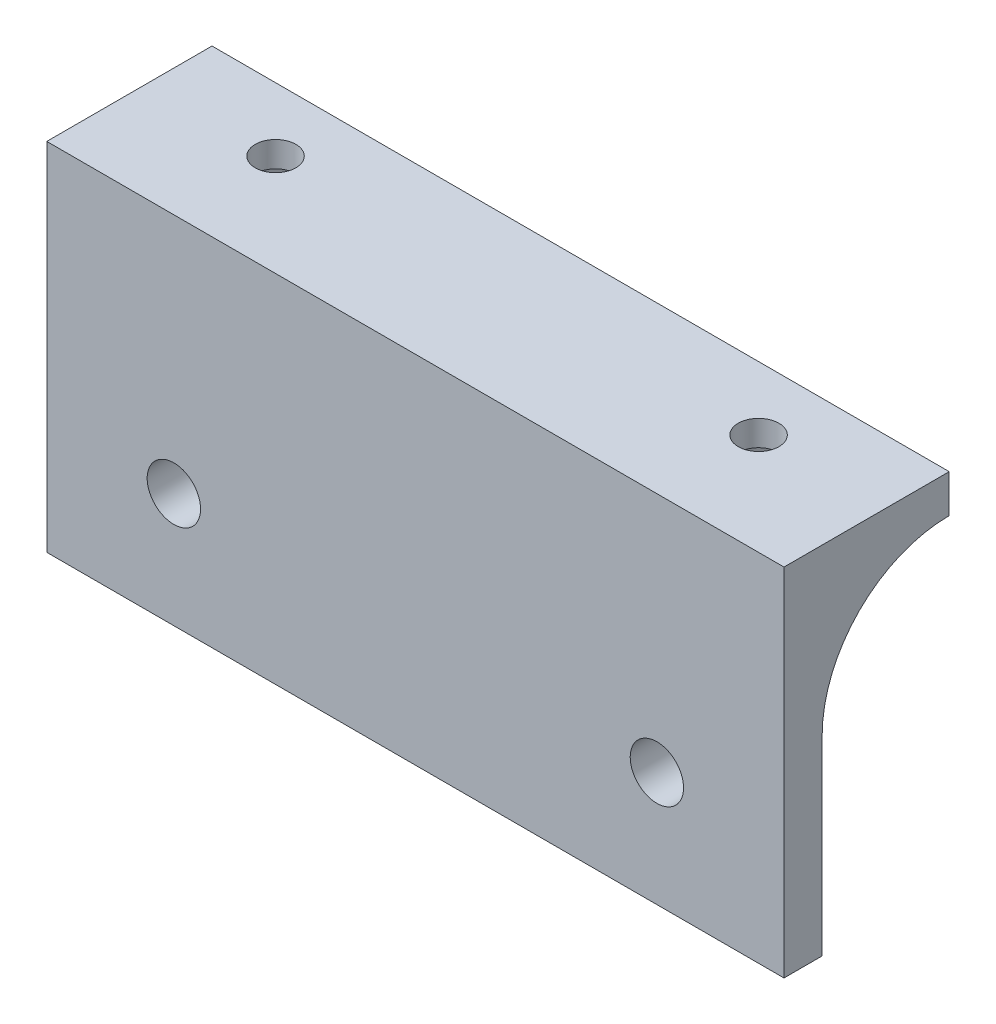
ISO-10303-21;
HEADER;
FILE_DESCRIPTION(('STEP AP214'),'2;1');
FILE_NAME('part.step','',(''),(''),'','','');
FILE_SCHEMA(('AUTOMOTIVE_DESIGN { 1 0 10303 214 1 1 1 1 }'));
ENDSEC;
DATA;
#1=APPLICATION_CONTEXT('core data for automotive mechanical design processes');
#2=APPLICATION_PROTOCOL_DEFINITION('international standard','automotive_design',2000,#1);
#3=PRODUCT_CONTEXT('',#1,'mechanical');
#4=PRODUCT('Part','Part','',(#3));
#5=PRODUCT_RELATED_PRODUCT_CATEGORY('part','',(#4));
#6=PRODUCT_DEFINITION_FORMATION('','',#4);
#7=PRODUCT_DEFINITION_CONTEXT('part definition',#1,'design');
#8=PRODUCT_DEFINITION('design','',#6,#7);
#9=PRODUCT_DEFINITION_SHAPE('','',#8);
#10=(LENGTH_UNIT() NAMED_UNIT(*) SI_UNIT(.MILLI.,.METRE.));
#11=(NAMED_UNIT(*) PLANE_ANGLE_UNIT() SI_UNIT($,.RADIAN.));
#12=(NAMED_UNIT(*) SI_UNIT($,.STERADIAN.) SOLID_ANGLE_UNIT());
#13=UNCERTAINTY_MEASURE_WITH_UNIT(LENGTH_MEASURE(1.E-05),#10,'distance_accuracy_value','');
#14=(GEOMETRIC_REPRESENTATION_CONTEXT(3) GLOBAL_UNCERTAINTY_ASSIGNED_CONTEXT((#13)) GLOBAL_UNIT_ASSIGNED_CONTEXT((#10,
#11,#12)) REPRESENTATION_CONTEXT('',''));
#15=CARTESIAN_POINT('',(0.,0.,0.));
#16=DIRECTION('',(0.,0.,1.));
#17=DIRECTION('',(1.,0.,0.));
#18=AXIS2_PLACEMENT_3D('',#15,#16,#17);
#19=CARTESIAN_POINT('',(19.,11.,-5.));
#20=DIRECTION('',(0.,1.,0.));
#21=DIRECTION('',(-1.,0.,0.));
#22=AXIS2_PLACEMENT_3D('',#19,#20,#21);
#23=CYLINDRICAL_SURFACE('',#22,1.6);
#24=CARTESIAN_POINT('',(19.,14.,-5.));
#25=DIRECTION('',(0.,1.,0.));
#26=DIRECTION('',(1.,0.,0.));
#27=AXIS2_PLACEMENT_3D('',#24,#25,#26);
#28=CIRCLE('',#27,1.6);
#29=CARTESIAN_POINT('',(20.6,14.,-5.));
#30=VERTEX_POINT('',#29);
#31=EDGE_CURVE('E180',#30,#30,#28,.T.);
#32=ORIENTED_EDGE('',*,*,#31,.T.);
#33=EDGE_LOOP('',(#32));
#34=FACE_BOUND('',#33,.T.);
#35=CARTESIAN_POINT('',(19.,12.,-5.));
#36=DIRECTION('',(0.,-1.,0.));
#37=DIRECTION('',(0.,0.,-1.));
#38=AXIS2_PLACEMENT_3D('',#35,#36,#37);
#39=CIRCLE('',#38,1.6);
#40=CARTESIAN_POINT('',(19.,12.,-6.60000000000001));
#41=VERTEX_POINT('',#40);
#42=EDGE_CURVE('E181',#41,#41,#39,.F.);
#43=ORIENTED_EDGE('',*,*,#42,.F.);
#44=EDGE_LOOP('',(#43));
#45=FACE_BOUND('',#44,.T.);
#46=ADVANCED_FACE('F33',(#34,#45),#23,.F.);
#47=CARTESIAN_POINT('',(0.,0.,0.));
#48=DIRECTION('',(0.,0.,1.));
#49=DIRECTION('',(1.,0.,0.));
#50=AXIS2_PLACEMENT_3D('',#47,#48,#49);
#51=PLANE('',#50);
#52=CARTESIAN_POINT('',(19.,-4.99999999999999,0.));
#53=DIRECTION('',(0.,0.,1.));
#54=DIRECTION('',(-1.,0.,0.));
#55=AXIS2_PLACEMENT_3D('',#52,#53,#54);
#56=CIRCLE('',#55,2.1);
#57=CARTESIAN_POINT('',(16.9,-4.99999999999999,0.));
#58=VERTEX_POINT('',#57);
#59=EDGE_CURVE('E259',#58,#58,#56,.T.);
#60=ORIENTED_EDGE('',*,*,#59,.T.);
#61=EDGE_LOOP('',(#60));
#62=FACE_BOUND('',#61,.T.);
#63=CARTESIAN_POINT('',(-19.,-5.,0.));
#64=DIRECTION('',(0.,0.,1.));
#65=DIRECTION('',(1.,0.,0.));
#66=AXIS2_PLACEMENT_3D('',#63,#64,#65);
#67=CIRCLE('',#66,2.1);
#68=CARTESIAN_POINT('',(-16.9,-5.,0.));
#69=VERTEX_POINT('',#68);
#70=EDGE_CURVE('E167',#69,#69,#67,.T.);
#71=ORIENTED_EDGE('',*,*,#70,.T.);
#72=EDGE_LOOP('',(#71));
#73=FACE_BOUND('',#72,.T.);
#74=DIRECTION('',(0.,-1.,0.));
#75=VECTOR('',#74,1.);
#76=CARTESIAN_POINT('',(-29.,14.,0.));
#77=LINE('',#76,#75);
#78=CARTESIAN_POINT('',(-29.,1.,0.));
#79=VERTEX_POINT('',#78);
#80=CARTESIAN_POINT('',(-29.,-14.,0.));
#81=VERTEX_POINT('',#80);
#82=EDGE_CURVE('E150',#79,#81,#77,.T.);
#83=ORIENTED_EDGE('',*,*,#82,.F.);
#84=DIRECTION('',(-1.,0.,0.));
#85=VECTOR('',#84,1.);
#86=CARTESIAN_POINT('',(29.,1.00000000000001,0.));
#87=LINE('',#86,#85);
#88=CARTESIAN_POINT('',(29.,1.00000000000001,0.));
#89=VERTEX_POINT('',#88);
#90=EDGE_CURVE('E162',#79,#89,#87,.F.);
#91=ORIENTED_EDGE('',*,*,#90,.T.);
#92=DIRECTION('',(0.,1.,0.));
#93=VECTOR('',#92,1.);
#94=CARTESIAN_POINT('',(29.,14.,0.));
#95=LINE('',#94,#93);
#96=CARTESIAN_POINT('',(29.,-14.,0.));
#97=VERTEX_POINT('',#96);
#98=EDGE_CURVE('E156',#97,#89,#95,.T.);
#99=ORIENTED_EDGE('',*,*,#98,.F.);
#100=DIRECTION('',(1.,0.,0.));
#101=VECTOR('',#100,1.);
#102=CARTESIAN_POINT('',(-29.,-14.,0.));
#103=LINE('',#102,#101);
#104=EDGE_CURVE('E139',#81,#97,#103,.T.);
#105=ORIENTED_EDGE('',*,*,#104,.F.);
#106=EDGE_LOOP('',(#83,#91,#99,#105));
#107=FACE_BOUND('',#106,.T.);
#108=ADVANCED_FACE('F160',(#62,#73,#107),#51,.F.);
#109=CARTESIAN_POINT('',(0.,0.,3.));
#110=DIRECTION('',(0.,0.,1.));
#111=DIRECTION('',(1.,0.,0.));
#112=AXIS2_PLACEMENT_3D('',#109,#110,#111);
#113=PLANE('',#112);
#114=DIRECTION('',(0.,-1.,0.));
#115=VECTOR('',#114,1.);
#116=CARTESIAN_POINT('',(-29.,14.,3.));
#117=LINE('',#116,#115);
#118=CARTESIAN_POINT('',(-29.,14.,3.));
#119=VERTEX_POINT('',#118);
#120=CARTESIAN_POINT('',(-29.,-14.,3.));
#121=VERTEX_POINT('',#120);
#122=EDGE_CURVE('E271',#119,#121,#117,.T.);
#123=ORIENTED_EDGE('',*,*,#122,.T.);
#124=DIRECTION('',(1.,0.,0.));
#125=VECTOR('',#124,1.);
#126=CARTESIAN_POINT('',(-29.,-14.,3.));
#127=LINE('',#126,#125);
#128=CARTESIAN_POINT('',(29.,-14.,3.));
#129=VERTEX_POINT('',#128);
#130=EDGE_CURVE('E158',#121,#129,#127,.T.);
#131=ORIENTED_EDGE('',*,*,#130,.T.);
#132=DIRECTION('',(0.,1.,0.));
#133=VECTOR('',#132,1.);
#134=CARTESIAN_POINT('',(29.,14.,3.));
#135=LINE('',#134,#133);
#136=CARTESIAN_POINT('',(29.,14.,3.));
#137=VERTEX_POINT('',#136);
#138=EDGE_CURVE('E149',#129,#137,#135,.T.);
#139=ORIENTED_EDGE('',*,*,#138,.T.);
#140=DIRECTION('',(-1.,0.,0.));
#141=VECTOR('',#140,1.);
#142=CARTESIAN_POINT('',(-29.,14.,3.));
#143=LINE('',#142,#141);
#144=EDGE_CURVE('E270',#137,#119,#143,.T.);
#145=ORIENTED_EDGE('',*,*,#144,.T.);
#146=EDGE_LOOP('',(#123,#131,#139,#145));
#147=FACE_BOUND('',#146,.T.);
#148=CARTESIAN_POINT('',(19.,-4.99999999999999,3.));
#149=DIRECTION('',(0.,0.,1.));
#150=DIRECTION('',(-1.,0.,0.));
#151=AXIS2_PLACEMENT_3D('',#148,#149,#150);
#152=CIRCLE('',#151,2.1);
#153=CARTESIAN_POINT('',(16.9,-4.99999999999999,3.));
#154=VERTEX_POINT('',#153);
#155=EDGE_CURVE('E262',#154,#154,#152,.T.);
#156=ORIENTED_EDGE('',*,*,#155,.F.);
#157=EDGE_LOOP('',(#156));
#158=FACE_BOUND('',#157,.T.);
#159=CARTESIAN_POINT('',(-19.,-5.,3.));
#160=DIRECTION('',(0.,0.,1.));
#161=DIRECTION('',(1.,0.,0.));
#162=AXIS2_PLACEMENT_3D('',#159,#160,#161);
#163=CIRCLE('',#162,2.1);
#164=CARTESIAN_POINT('',(-16.9,-5.,3.));
#165=VERTEX_POINT('',#164);
#166=EDGE_CURVE('E163',#165,#165,#163,.T.);
#167=ORIENTED_EDGE('',*,*,#166,.F.);
#168=EDGE_LOOP('',(#167));
#169=FACE_BOUND('',#168,.T.);
#170=ADVANCED_FACE('F274',(#147,#158,#169),#113,.T.);
#171=CARTESIAN_POINT('',(29.,14.,3.));
#172=DIRECTION('',(-1.,0.,0.));
#173=DIRECTION('',(0.,-1.,0.));
#174=AXIS2_PLACEMENT_3D('',#171,#172,#173);
#175=PLANE('',#174);
#176=DIRECTION('',(0.,0.,-1.));
#177=VECTOR('',#176,1.);
#178=CARTESIAN_POINT('',(29.,14.,3.));
#179=LINE('',#178,#177);
#180=CARTESIAN_POINT('',(29.,14.,-10.));
#181=VERTEX_POINT('',#180);
#182=EDGE_CURVE('E175',#137,#181,#179,.T.);
#183=ORIENTED_EDGE('',*,*,#182,.F.);
#184=ORIENTED_EDGE('',*,*,#138,.F.);
#185=DIRECTION('',(0.,0.,-1.));
#186=VECTOR('',#185,1.);
#187=CARTESIAN_POINT('',(29.,-14.,3.));
#188=LINE('',#187,#186);
#189=EDGE_CURVE('E143',#129,#97,#188,.T.);
#190=ORIENTED_EDGE('',*,*,#189,.T.);
#191=ORIENTED_EDGE('',*,*,#98,.T.);
#192=CARTESIAN_POINT('',(29.,1.00000000000001,-10.));
#193=DIRECTION('',(-1.,0.,0.));
#194=DIRECTION('',(0.,-1.,0.));
#195=AXIS2_PLACEMENT_3D('',#192,#193,#194);
#196=CIRCLE('',#195,10.);
#197=CARTESIAN_POINT('',(29.,11.,-10.));
#198=VERTEX_POINT('',#197);
#199=EDGE_CURVE('E11',#89,#198,#196,.T.);
#200=ORIENTED_EDGE('',*,*,#199,.T.);
#201=DIRECTION('',(0.,1.,0.));
#202=VECTOR('',#201,1.);
#203=CARTESIAN_POINT('',(29.,11.,-10.));
#204=LINE('',#203,#202);
#205=EDGE_CURVE('E253',#198,#181,#204,.T.);
#206=ORIENTED_EDGE('',*,*,#205,.T.);
#207=EDGE_LOOP('',(#183,#184,#190,#191,#200,#206));
#208=FACE_BOUND('',#207,.T.);
#209=ADVANCED_FACE('F155',(#208),#175,.F.);
#210=CARTESIAN_POINT('',(-29.,14.,3.));
#211=DIRECTION('',(0.,-1.,0.));
#212=DIRECTION('',(1.,0.,0.));
#213=AXIS2_PLACEMENT_3D('',#210,#211,#212);
#214=PLANE('',#213);
#215=ORIENTED_EDGE('',*,*,#182,.T.);
#216=DIRECTION('',(-1.,0.,0.));
#217=VECTOR('',#216,1.);
#218=CARTESIAN_POINT('',(29.,14.,-10.));
#219=LINE('',#218,#217);
#220=CARTESIAN_POINT('',(-29.,14.,-9.99999999999999));
#221=VERTEX_POINT('',#220);
#222=EDGE_CURVE('E249',#181,#221,#219,.T.);
#223=ORIENTED_EDGE('',*,*,#222,.T.);
#224=DIRECTION('',(0.,0.,-1.));
#225=VECTOR('',#224,1.);
#226=CARTESIAN_POINT('',(-29.,14.,3.));
#227=LINE('',#226,#225);
#228=EDGE_CURVE('E173',#119,#221,#227,.T.);
#229=ORIENTED_EDGE('',*,*,#228,.F.);
#230=ORIENTED_EDGE('',*,*,#144,.F.);
#231=EDGE_LOOP('',(#215,#223,#229,#230));
#232=FACE_BOUND('',#231,.T.);
#233=CARTESIAN_POINT('',(-19.,14.,-5.));
#234=DIRECTION('',(0.,1.,0.));
#235=DIRECTION('',(-1.,0.,0.));
#236=AXIS2_PLACEMENT_3D('',#233,#234,#235);
#237=CIRCLE('',#236,1.6);
#238=CARTESIAN_POINT('',(-20.6,14.,-5.));
#239=VERTEX_POINT('',#238);
#240=EDGE_CURVE('E246',#239,#239,#237,.T.);
#241=ORIENTED_EDGE('',*,*,#240,.F.);
#242=EDGE_LOOP('',(#241));
#243=FACE_BOUND('',#242,.T.);
#244=ORIENTED_EDGE('',*,*,#31,.F.);
#245=EDGE_LOOP('',(#244));
#246=FACE_BOUND('',#245,.T.);
#247=ADVANCED_FACE('F279',(#232,#243,#246),#214,.F.);
#248=CARTESIAN_POINT('',(-29.,14.,3.));
#249=DIRECTION('',(1.,0.,0.));
#250=DIRECTION('',(0.,1.,0.));
#251=AXIS2_PLACEMENT_3D('',#248,#249,#250);
#252=PLANE('',#251);
#253=ORIENTED_EDGE('',*,*,#228,.T.);
#254=DIRECTION('',(0.,1.,0.));
#255=VECTOR('',#254,1.);
#256=CARTESIAN_POINT('',(-29.,11.,-9.99999999999999));
#257=LINE('',#256,#255);
#258=CARTESIAN_POINT('',(-29.,11.,-9.99999999999999));
#259=VERTEX_POINT('',#258);
#260=EDGE_CURVE('E256',#259,#221,#257,.T.);
#261=ORIENTED_EDGE('',*,*,#260,.F.);
#262=CARTESIAN_POINT('',(-29.,1.,-10.));
#263=DIRECTION('',(1.,0.,0.));
#264=DIRECTION('',(0.,1.,0.));
#265=AXIS2_PLACEMENT_3D('',#262,#263,#264);
#266=CIRCLE('',#265,10.);
#267=EDGE_CURVE('E43',#259,#79,#266,.T.);
#268=ORIENTED_EDGE('',*,*,#267,.T.);
#269=ORIENTED_EDGE('',*,*,#82,.T.);
#270=DIRECTION('',(0.,0.,-1.));
#271=VECTOR('',#270,1.);
#272=CARTESIAN_POINT('',(-29.,-14.,3.));
#273=LINE('',#272,#271);
#274=EDGE_CURVE('E146',#121,#81,#273,.T.);
#275=ORIENTED_EDGE('',*,*,#274,.F.);
#276=ORIENTED_EDGE('',*,*,#122,.F.);
#277=EDGE_LOOP('',(#253,#261,#268,#269,#275,#276));
#278=FACE_BOUND('',#277,.T.);
#279=ADVANCED_FACE('F286',(#278),#252,.F.);
#280=CARTESIAN_POINT('',(-29.,-14.,3.));
#281=DIRECTION('',(0.,1.,0.));
#282=DIRECTION('',(-1.,0.,0.));
#283=AXIS2_PLACEMENT_3D('',#280,#281,#282);
#284=PLANE('',#283);
#285=ORIENTED_EDGE('',*,*,#104,.T.);
#286=ORIENTED_EDGE('',*,*,#189,.F.);
#287=ORIENTED_EDGE('',*,*,#130,.F.);
#288=ORIENTED_EDGE('',*,*,#274,.T.);
#289=EDGE_LOOP('',(#285,#286,#287,#288));
#290=FACE_BOUND('',#289,.T.);
#291=ADVANCED_FACE('F141',(#290),#284,.F.);
#292=CARTESIAN_POINT('',(-19.,-5.,3.));
#293=DIRECTION('',(0.,0.,-1.));
#294=DIRECTION('',(-1.,0.,0.));
#295=AXIS2_PLACEMENT_3D('',#292,#293,#294);
#296=CYLINDRICAL_SURFACE('',#295,2.1);
#297=ORIENTED_EDGE('',*,*,#166,.T.);
#298=EDGE_LOOP('',(#297));
#299=FACE_BOUND('',#298,.T.);
#300=ORIENTED_EDGE('',*,*,#70,.F.);
#301=EDGE_LOOP('',(#300));
#302=FACE_BOUND('',#301,.T.);
#303=ADVANCED_FACE('F387',(#299,#302),#296,.F.);
#304=CARTESIAN_POINT('',(19.,-4.99999999999999,3.));
#305=DIRECTION('',(0.,0.,-1.));
#306=DIRECTION('',(-1.,0.,0.));
#307=AXIS2_PLACEMENT_3D('',#304,#305,#306);
#308=CYLINDRICAL_SURFACE('',#307,2.1);
#309=ORIENTED_EDGE('',*,*,#155,.T.);
#310=EDGE_LOOP('',(#309));
#311=FACE_BOUND('',#310,.T.);
#312=ORIENTED_EDGE('',*,*,#59,.F.);
#313=EDGE_LOOP('',(#312));
#314=FACE_BOUND('',#313,.T.);
#315=ADVANCED_FACE('F384',(#311,#314),#308,.F.);
#316=CARTESIAN_POINT('',(29.,11.,-10.));
#317=DIRECTION('',(0.,0.,-1.));
#318=DIRECTION('',(-1.,0.,0.));
#319=AXIS2_PLACEMENT_3D('',#316,#317,#318);
#320=PLANE('',#319);
#321=ORIENTED_EDGE('',*,*,#222,.F.);
#322=ORIENTED_EDGE('',*,*,#205,.F.);
#323=DIRECTION('',(-1.,0.,0.));
#324=VECTOR('',#323,1.);
#325=CARTESIAN_POINT('',(29.,11.,-10.));
#326=LINE('',#325,#324);
#327=EDGE_CURVE('E250',#198,#259,#326,.T.);
#328=ORIENTED_EDGE('',*,*,#327,.T.);
#329=ORIENTED_EDGE('',*,*,#260,.T.);
#330=EDGE_LOOP('',(#321,#322,#328,#329));
#331=FACE_BOUND('',#330,.T.);
#332=ADVANCED_FACE('F285',(#331),#320,.T.);
#333=CARTESIAN_POINT('',(-19.,11.,-5.));
#334=DIRECTION('',(0.,1.,0.));
#335=DIRECTION('',(-1.,0.,0.));
#336=AXIS2_PLACEMENT_3D('',#333,#334,#335);
#337=CYLINDRICAL_SURFACE('',#336,1.6);
#338=CARTESIAN_POINT('',(-19.,12.,-5.));
#339=DIRECTION('',(0.,1.,0.));
#340=DIRECTION('',(0.,0.,1.));
#341=AXIS2_PLACEMENT_3D('',#338,#339,#340);
#342=CIRCLE('',#341,1.6);
#343=CARTESIAN_POINT('',(-19.,12.,-3.4));
#344=VERTEX_POINT('',#343);
#345=EDGE_CURVE('E177',#344,#344,#342,.F.);
#346=ORIENTED_EDGE('',*,*,#345,.T.);
#347=EDGE_LOOP('',(#346));
#348=FACE_BOUND('',#347,.T.);
#349=ORIENTED_EDGE('',*,*,#240,.T.);
#350=EDGE_LOOP('',(#349));
#351=FACE_BOUND('',#350,.T.);
#352=ADVANCED_FACE('F378',(#348,#351),#337,.F.);
#353=CARTESIAN_POINT('',(-17.3834192462691,2.,-2.2));
#354=DIRECTION('',(0.866025403784439,0.,0.5));
#355=DIRECTION('',(0.5,0.,-0.866025403784439));
#356=AXIS2_PLACEMENT_3D('',#353,#354,#355);
#357=PLANE('',#356);
#358=DIRECTION('',(0.,1.,0.));
#359=VECTOR('',#358,1.);
#360=CARTESIAN_POINT('',(-17.3834192462691,2.,-2.2));
#361=LINE('',#360,#359);
#362=CARTESIAN_POINT('',(-17.3834192462691,7.25779513886481,-2.2));
#363=VERTEX_POINT('',#362);
#364=CARTESIAN_POINT('',(-17.3834192462691,12.,-2.2));
#365=VERTEX_POINT('',#364);
#366=EDGE_CURVE('E104',#363,#365,#361,.T.);
#367=ORIENTED_EDGE('',*,*,#366,.T.);
#368=DIRECTION('',(0.5,0.,-0.866025403784439));
#369=VECTOR('',#368,1.);
#370=CARTESIAN_POINT('',(-17.3834192462691,12.,-2.2));
#371=LINE('',#370,#369);
#372=CARTESIAN_POINT('',(-15.7668384925381,12.,-5.));
#373=VERTEX_POINT('',#372);
#374=EDGE_CURVE('E184',#365,#373,#371,.T.);
#375=ORIENTED_EDGE('',*,*,#374,.T.);
#376=DIRECTION('',(0.,1.,0.));
#377=VECTOR('',#376,1.);
#378=CARTESIAN_POINT('',(-15.7668384925381,2.,-5.));
#379=LINE('',#378,#377);
#380=CARTESIAN_POINT('',(-15.7668384925381,9.66025403784439,-5.));
#381=VERTEX_POINT('',#380);
#382=EDGE_CURVE('E221',#381,#373,#379,.T.);
#383=ORIENTED_EDGE('',*,*,#382,.F.);
#384=CARTESIAN_POINT('',(-12.88008714659,1.,-10.));
#385=DIRECTION('',(0.866025403784439,0.,0.5));
#386=DIRECTION('',(0.5,0.,-0.866025403784439));
#387=AXIS2_PLACEMENT_3D('',#384,#385,#386);
#388=ELLIPSE('',#387,11.5470053837925,10.);
#389=EDGE_CURVE('E37',#363,#381,#388,.F.);
#390=ORIENTED_EDGE('',*,*,#389,.F.);
#391=EDGE_LOOP('',(#367,#375,#383,#390));
#392=FACE_BOUND('',#391,.T.);
#393=ADVANCED_FACE('F220',(#392),#357,.F.);
#394=CARTESIAN_POINT('',(-20.616580753731,2.,-2.2));
#395=DIRECTION('',(0.,0.,1.));
#396=DIRECTION('',(1.,0.,0.));
#397=AXIS2_PLACEMENT_3D('',#394,#395,#396);
#398=PLANE('',#397);
#399=DIRECTION('',(0.,1.,0.));
#400=VECTOR('',#399,1.);
#401=CARTESIAN_POINT('',(-20.616580753731,2.,-2.2));
#402=LINE('',#401,#400);
#403=CARTESIAN_POINT('',(-20.616580753731,7.25779513886481,-2.2));
#404=VERTEX_POINT('',#403);
#405=CARTESIAN_POINT('',(-20.616580753731,12.,-2.2));
#406=VERTEX_POINT('',#405);
#407=EDGE_CURVE('E228',#404,#406,#402,.T.);
#408=ORIENTED_EDGE('',*,*,#407,.T.);
#409=DIRECTION('',(1.,0.,0.));
#410=VECTOR('',#409,1.);
#411=CARTESIAN_POINT('',(-20.616580753731,12.,-2.2));
#412=LINE('',#411,#410);
#413=EDGE_CURVE('E227',#406,#365,#412,.T.);
#414=ORIENTED_EDGE('',*,*,#413,.T.);
#415=ORIENTED_EDGE('',*,*,#366,.F.);
#416=DIRECTION('',(1.,0.,0.));
#417=VECTOR('',#416,1.);
#418=CARTESIAN_POINT('',(-19.,7.25779513886481,-2.2));
#419=LINE('',#418,#417);
#420=EDGE_CURVE('E206',#404,#363,#419,.T.);
#421=ORIENTED_EDGE('',*,*,#420,.F.);
#422=EDGE_LOOP('',(#408,#414,#415,#421));
#423=FACE_BOUND('',#422,.T.);
#424=ADVANCED_FACE('F224',(#423),#398,.F.);
#425=CARTESIAN_POINT('',(-22.2331615074619,2.,-5.));
#426=DIRECTION('',(-0.866025403784439,0.,0.5));
#427=DIRECTION('',(0.5,0.,0.866025403784439));
#428=AXIS2_PLACEMENT_3D('',#425,#426,#427);
#429=PLANE('',#428);
#430=DIRECTION('',(0.,1.,0.));
#431=VECTOR('',#430,1.);
#432=CARTESIAN_POINT('',(-22.2331615074619,2.,-5.));
#433=LINE('',#432,#431);
#434=CARTESIAN_POINT('',(-22.2331615074619,9.66025403784439,-5.));
#435=VERTEX_POINT('',#434);
#436=CARTESIAN_POINT('',(-22.2331615074619,12.,-5.));
#437=VERTEX_POINT('',#436);
#438=EDGE_CURVE('E230',#435,#437,#433,.T.);
#439=ORIENTED_EDGE('',*,*,#438,.T.);
#440=DIRECTION('',(0.5,0.,0.866025403784439));
#441=VECTOR('',#440,1.);
#442=CARTESIAN_POINT('',(-22.2331615074619,12.,-5.));
#443=LINE('',#442,#441);
#444=EDGE_CURVE('E333',#437,#406,#443,.T.);
#445=ORIENTED_EDGE('',*,*,#444,.T.);
#446=ORIENTED_EDGE('',*,*,#407,.F.);
#447=CARTESIAN_POINT('',(-25.11991285341,1.,-10.));
#448=DIRECTION('',(-0.866025403784439,0.,0.5));
#449=DIRECTION('',(0.5,0.,0.866025403784439));
#450=AXIS2_PLACEMENT_3D('',#447,#448,#449);
#451=ELLIPSE('',#450,11.5470053837925,10.);
#452=EDGE_CURVE('E209',#435,#404,#451,.F.);
#453=ORIENTED_EDGE('',*,*,#452,.F.);
#454=EDGE_LOOP('',(#439,#445,#446,#453));
#455=FACE_BOUND('',#454,.T.);
#456=ADVANCED_FACE('F337',(#455),#429,.F.);
#457=CARTESIAN_POINT('',(-20.616580753731,2.,-7.8));
#458=DIRECTION('',(-0.866025403784439,0.,-0.5));
#459=DIRECTION('',(-0.5,0.,0.866025403784439));
#460=AXIS2_PLACEMENT_3D('',#457,#458,#459);
#461=PLANE('',#460);
#462=DIRECTION('',(0.,1.,0.));
#463=VECTOR('',#462,1.);
#464=CARTESIAN_POINT('',(-20.616580753731,2.,-7.8));
#465=LINE('',#464,#463);
#466=CARTESIAN_POINT('',(-20.616580753731,10.7549987186058,-7.8));
#467=VERTEX_POINT('',#466);
#468=CARTESIAN_POINT('',(-20.616580753731,12.,-7.8));
#469=VERTEX_POINT('',#468);
#470=EDGE_CURVE('E237',#467,#469,#465,.T.);
#471=ORIENTED_EDGE('',*,*,#470,.T.);
#472=DIRECTION('',(-0.5,0.,0.866025403784438));
#473=VECTOR('',#472,1.);
#474=CARTESIAN_POINT('',(-20.616580753731,12.,-7.8));
#475=LINE('',#474,#473);
#476=EDGE_CURVE('E331',#469,#437,#475,.T.);
#477=ORIENTED_EDGE('',*,*,#476,.T.);
#478=ORIENTED_EDGE('',*,*,#438,.F.);
#479=CARTESIAN_POINT('',(-19.3464101615138,1.,-10.));
#480=DIRECTION('',(-0.866025403784439,0.,-0.5));
#481=DIRECTION('',(0.5,0.,-0.866025403784439));
#482=AXIS2_PLACEMENT_3D('',#479,#480,#481);
#483=ELLIPSE('',#482,11.5470053837925,10.);
#484=EDGE_CURVE('E212',#467,#435,#483,.F.);
#485=ORIENTED_EDGE('',*,*,#484,.F.);
#486=EDGE_LOOP('',(#471,#477,#478,#485));
#487=FACE_BOUND('',#486,.T.);
#488=ADVANCED_FACE('F354',(#487),#461,.F.);
#489=CARTESIAN_POINT('',(-17.3834192462691,2.,-7.8));
#490=DIRECTION('',(0.,0.,-1.));
#491=DIRECTION('',(-1.,0.,0.));
#492=AXIS2_PLACEMENT_3D('',#489,#490,#491);
#493=PLANE('',#492);
#494=DIRECTION('',(0.,1.,0.));
#495=VECTOR('',#494,1.);
#496=CARTESIAN_POINT('',(-17.3834192462691,2.,-7.8));
#497=LINE('',#496,#495);
#498=CARTESIAN_POINT('',(-17.3834192462691,10.7549987186058,-7.8));
#499=VERTEX_POINT('',#498);
#500=CARTESIAN_POINT('',(-17.3834192462691,12.,-7.8));
#501=VERTEX_POINT('',#500);
#502=EDGE_CURVE('E240',#499,#501,#497,.T.);
#503=ORIENTED_EDGE('',*,*,#502,.T.);
#504=DIRECTION('',(-1.,0.,0.));
#505=VECTOR('',#504,1.);
#506=CARTESIAN_POINT('',(-17.3834192462691,12.,-7.8));
#507=LINE('',#506,#505);
#508=EDGE_CURVE('E328',#501,#469,#507,.T.);
#509=ORIENTED_EDGE('',*,*,#508,.T.);
#510=ORIENTED_EDGE('',*,*,#470,.F.);
#511=DIRECTION('',(1.,0.,0.));
#512=VECTOR('',#511,1.);
#513=CARTESIAN_POINT('',(-19.,10.7549987186058,-7.8));
#514=LINE('',#513,#512);
#515=EDGE_CURVE('E215',#499,#467,#514,.F.);
#516=ORIENTED_EDGE('',*,*,#515,.F.);
#517=EDGE_LOOP('',(#503,#509,#510,#516));
#518=FACE_BOUND('',#517,.T.);
#519=ADVANCED_FACE('F356',(#518),#493,.F.);
#520=CARTESIAN_POINT('',(-15.7668384925381,2.,-5.));
#521=DIRECTION('',(0.866025403784439,0.,-0.5));
#522=DIRECTION('',(-0.5,0.,-0.866025403784439));
#523=AXIS2_PLACEMENT_3D('',#520,#521,#522);
#524=PLANE('',#523);
#525=ORIENTED_EDGE('',*,*,#382,.T.);
#526=DIRECTION('',(-0.5,0.,-0.866025403784439));
#527=VECTOR('',#526,1.);
#528=CARTESIAN_POINT('',(-15.7668384925381,12.,-5.));
#529=LINE('',#528,#527);
#530=EDGE_CURVE('E325',#373,#501,#529,.T.);
#531=ORIENTED_EDGE('',*,*,#530,.T.);
#532=ORIENTED_EDGE('',*,*,#502,.F.);
#533=CARTESIAN_POINT('',(-18.6535898384862,1.,-10.));
#534=DIRECTION('',(0.866025403784439,0.,-0.5));
#535=DIRECTION('',(0.5,0.,0.866025403784439));
#536=AXIS2_PLACEMENT_3D('',#533,#534,#535);
#537=ELLIPSE('',#536,11.5470053837925,10.);
#538=EDGE_CURVE('E95',#381,#499,#537,.F.);
#539=ORIENTED_EDGE('',*,*,#538,.F.);
#540=EDGE_LOOP('',(#525,#531,#532,#539));
#541=FACE_BOUND('',#540,.T.);
#542=ADVANCED_FACE('F357',(#541),#524,.F.);
#543=CARTESIAN_POINT('',(0.,12.,0.));
#544=DIRECTION('',(0.,1.,0.));
#545=DIRECTION('',(0.,0.,1.));
#546=AXIS2_PLACEMENT_3D('',#543,#544,#545);
#547=PLANE('',#546);
#548=ORIENTED_EDGE('',*,*,#374,.F.);
#549=ORIENTED_EDGE('',*,*,#413,.F.);
#550=ORIENTED_EDGE('',*,*,#444,.F.);
#551=ORIENTED_EDGE('',*,*,#476,.F.);
#552=ORIENTED_EDGE('',*,*,#508,.F.);
#553=ORIENTED_EDGE('',*,*,#530,.F.);
#554=EDGE_LOOP('',(#548,#549,#550,#551,#552,#553));
#555=FACE_BOUND('',#554,.T.);
#556=ORIENTED_EDGE('',*,*,#345,.F.);
#557=EDGE_LOOP('',(#556));
#558=FACE_BOUND('',#557,.T.);
#559=ADVANCED_FACE('F341',(#555,#558),#547,.F.);
#560=CARTESIAN_POINT('',(20.616580753731,2.00000000000001,-2.20000000000001));
#561=DIRECTION('',(0.,0.,1.));
#562=DIRECTION('',(1.,0.,0.));
#563=AXIS2_PLACEMENT_3D('',#560,#561,#562);
#564=PLANE('',#563);
#565=DIRECTION('',(0.,1.,0.));
#566=VECTOR('',#565,1.);
#567=CARTESIAN_POINT('',(17.3834192462691,2.00000000000001,-2.20000000000001));
#568=LINE('',#567,#566);
#569=CARTESIAN_POINT('',(17.3834192462691,7.25779513886482,-2.20000000000001));
#570=VERTEX_POINT('',#569);
#571=CARTESIAN_POINT('',(17.3834192462691,12.,-2.20000000000001));
#572=VERTEX_POINT('',#571);
#573=EDGE_CURVE('E185',#570,#572,#568,.T.);
#574=ORIENTED_EDGE('',*,*,#573,.T.);
#575=DIRECTION('',(1.,0.,0.));
#576=VECTOR('',#575,1.);
#577=CARTESIAN_POINT('',(20.616580753731,12.,-2.20000000000001));
#578=LINE('',#577,#576);
#579=CARTESIAN_POINT('',(20.616580753731,12.,-2.20000000000001));
#580=VERTEX_POINT('',#579);
#581=EDGE_CURVE('E594',#572,#580,#578,.T.);
#582=ORIENTED_EDGE('',*,*,#581,.T.);
#583=DIRECTION('',(0.,1.,0.));
#584=VECTOR('',#583,1.);
#585=CARTESIAN_POINT('',(20.616580753731,2.00000000000001,-2.20000000000001));
#586=LINE('',#585,#584);
#587=CARTESIAN_POINT('',(20.616580753731,7.25779513886482,-2.20000000000001));
#588=VERTEX_POINT('',#587);
#589=EDGE_CURVE('E320',#588,#580,#586,.T.);
#590=ORIENTED_EDGE('',*,*,#589,.F.);
#591=DIRECTION('',(1.,0.,0.));
#592=VECTOR('',#591,1.);
#593=CARTESIAN_POINT('',(19.,7.25779513886482,-2.20000000000001));
#594=LINE('',#593,#592);
#595=EDGE_CURVE('E187',#570,#588,#594,.T.);
#596=ORIENTED_EDGE('',*,*,#595,.F.);
#597=EDGE_LOOP('',(#574,#582,#590,#596));
#598=FACE_BOUND('',#597,.T.);
#599=ADVANCED_FACE('F364',(#598),#564,.F.);
#600=CARTESIAN_POINT('',(17.3834192462691,2.00000000000001,-2.20000000000001));
#601=DIRECTION('',(-0.866025403784439,0.,0.5));
#602=DIRECTION('',(0.5,0.,0.866025403784439));
#603=AXIS2_PLACEMENT_3D('',#600,#601,#602);
#604=PLANE('',#603);
#605=DIRECTION('',(0.,1.,0.));
#606=VECTOR('',#605,1.);
#607=CARTESIAN_POINT('',(15.7668384925381,2.00000000000001,-5.));
#608=LINE('',#607,#606);
#609=CARTESIAN_POINT('',(15.7668384925381,9.66025403784439,-5.));
#610=VERTEX_POINT('',#609);
#611=CARTESIAN_POINT('',(15.7668384925381,12.,-5.));
#612=VERTEX_POINT('',#611);
#613=EDGE_CURVE('E298',#610,#612,#608,.T.);
#614=ORIENTED_EDGE('',*,*,#613,.T.);
#615=DIRECTION('',(0.5,0.,0.866025403784439));
#616=VECTOR('',#615,1.);
#617=CARTESIAN_POINT('',(17.3834192462691,12.,-2.20000000000001));
#618=LINE('',#617,#616);
#619=EDGE_CURVE('E323',#612,#572,#618,.T.);
#620=ORIENTED_EDGE('',*,*,#619,.T.);
#621=ORIENTED_EDGE('',*,*,#573,.F.);
#622=CARTESIAN_POINT('',(12.88008714659,1.00000000000001,-10.));
#623=DIRECTION('',(-0.866025403784439,0.,0.5));
#624=DIRECTION('',(0.5,0.,0.866025403784439));
#625=AXIS2_PLACEMENT_3D('',#622,#623,#624);
#626=ELLIPSE('',#625,11.5470053837925,10.);
#627=EDGE_CURVE('E189',#610,#570,#626,.F.);
#628=ORIENTED_EDGE('',*,*,#627,.F.);
#629=EDGE_LOOP('',(#614,#620,#621,#628));
#630=FACE_BOUND('',#629,.T.);
#631=ADVANCED_FACE('F295',(#630),#604,.F.);
#632=CARTESIAN_POINT('',(15.7668384925381,2.00000000000001,-5.));
#633=DIRECTION('',(-0.866025403784439,0.,-0.499999999999999));
#634=DIRECTION('',(-0.499999999999999,0.,0.866025403784439));
#635=AXIS2_PLACEMENT_3D('',#632,#633,#634);
#636=PLANE('',#635);
#637=DIRECTION('',(0.,1.,0.));
#638=VECTOR('',#637,1.);
#639=CARTESIAN_POINT('',(17.3834192462691,2.00000000000001,-7.80000000000001));
#640=LINE('',#639,#638);
#641=CARTESIAN_POINT('',(17.3834192462691,10.7549987186058,-7.80000000000001));
#642=VERTEX_POINT('',#641);
#643=CARTESIAN_POINT('',(17.3834192462691,12.,-7.80000000000001));
#644=VERTEX_POINT('',#643);
#645=EDGE_CURVE('E308',#642,#644,#640,.T.);
#646=ORIENTED_EDGE('',*,*,#645,.T.);
#647=DIRECTION('',(-0.499999999999999,0.,0.866025403784439));
#648=VECTOR('',#647,1.);
#649=CARTESIAN_POINT('',(15.7668384925381,12.,-5.));
#650=LINE('',#649,#648);
#651=EDGE_CURVE('E306',#644,#612,#650,.T.);
#652=ORIENTED_EDGE('',*,*,#651,.T.);
#653=ORIENTED_EDGE('',*,*,#613,.F.);
#654=CARTESIAN_POINT('',(18.6535898384862,1.00000000000001,-10.));
#655=DIRECTION('',(-0.866025403784439,0.,-0.499999999999999));
#656=DIRECTION('',(0.499999999999999,0.,-0.866025403784439));
#657=AXIS2_PLACEMENT_3D('',#654,#655,#656);
#658=ELLIPSE('',#657,11.5470053837925,10.);
#659=EDGE_CURVE('E192',#642,#610,#658,.F.);
#660=ORIENTED_EDGE('',*,*,#659,.F.);
#661=EDGE_LOOP('',(#646,#652,#653,#660));
#662=FACE_BOUND('',#661,.T.);
#663=ADVANCED_FACE('F303',(#662),#636,.F.);
#664=CARTESIAN_POINT('',(17.3834192462691,2.00000000000001,-7.80000000000001));
#665=DIRECTION('',(0.,0.,-1.));
#666=DIRECTION('',(-1.,0.,0.));
#667=AXIS2_PLACEMENT_3D('',#664,#665,#666);
#668=PLANE('',#667);
#669=DIRECTION('',(0.,1.,0.));
#670=VECTOR('',#669,1.);
#671=CARTESIAN_POINT('',(20.616580753731,2.00000000000001,-7.80000000000001));
#672=LINE('',#671,#670);
#673=CARTESIAN_POINT('',(20.616580753731,10.7549987186058,-7.80000000000001));
#674=VERTEX_POINT('',#673);
#675=CARTESIAN_POINT('',(20.616580753731,12.,-7.80000000000001));
#676=VERTEX_POINT('',#675);
#677=EDGE_CURVE('E311',#674,#676,#672,.T.);
#678=ORIENTED_EDGE('',*,*,#677,.T.);
#679=DIRECTION('',(-1.,0.,0.));
#680=VECTOR('',#679,1.);
#681=CARTESIAN_POINT('',(17.3834192462691,12.,-7.80000000000001));
#682=LINE('',#681,#680);
#683=EDGE_CURVE('E602',#676,#644,#682,.T.);
#684=ORIENTED_EDGE('',*,*,#683,.T.);
#685=ORIENTED_EDGE('',*,*,#645,.F.);
#686=DIRECTION('',(1.,0.,0.));
#687=VECTOR('',#686,1.);
#688=CARTESIAN_POINT('',(19.,10.7549987186058,-7.80000000000001));
#689=LINE('',#688,#687);
#690=EDGE_CURVE('E195',#674,#642,#689,.F.);
#691=ORIENTED_EDGE('',*,*,#690,.F.);
#692=EDGE_LOOP('',(#678,#684,#685,#691));
#693=FACE_BOUND('',#692,.T.);
#694=ADVANCED_FACE('F492',(#693),#668,.F.);
#695=CARTESIAN_POINT('',(20.616580753731,2.00000000000001,-7.80000000000001));
#696=DIRECTION('',(0.866025403784439,0.,-0.5));
#697=DIRECTION('',(-0.5,0.,-0.866025403784439));
#698=AXIS2_PLACEMENT_3D('',#695,#696,#697);
#699=PLANE('',#698);
#700=DIRECTION('',(0.,1.,0.));
#701=VECTOR('',#700,1.);
#702=CARTESIAN_POINT('',(22.2331615074619,2.00000000000001,-5.));
#703=LINE('',#702,#701);
#704=CARTESIAN_POINT('',(22.2331615074619,9.66025403784439,-5.));
#705=VERTEX_POINT('',#704);
#706=CARTESIAN_POINT('',(22.2331615074619,12.,-5.));
#707=VERTEX_POINT('',#706);
#708=EDGE_CURVE('E317',#705,#707,#703,.T.);
#709=ORIENTED_EDGE('',*,*,#708,.T.);
#710=DIRECTION('',(-0.5,0.,-0.866025403784438));
#711=VECTOR('',#710,1.);
#712=CARTESIAN_POINT('',(20.616580753731,12.,-7.80000000000001));
#713=LINE('',#712,#711);
#714=EDGE_CURVE('E607',#707,#676,#713,.T.);
#715=ORIENTED_EDGE('',*,*,#714,.T.);
#716=ORIENTED_EDGE('',*,*,#677,.F.);
#717=CARTESIAN_POINT('',(19.3464101615138,1.00000000000001,-10.));
#718=DIRECTION('',(0.866025403784439,0.,-0.5));
#719=DIRECTION('',(0.5,0.,0.866025403784439));
#720=AXIS2_PLACEMENT_3D('',#717,#718,#719);
#721=ELLIPSE('',#720,11.5470053837925,10.);
#722=EDGE_CURVE('E198',#705,#674,#721,.F.);
#723=ORIENTED_EDGE('',*,*,#722,.F.);
#724=EDGE_LOOP('',(#709,#715,#716,#723));
#725=FACE_BOUND('',#724,.T.);
#726=ADVANCED_FACE('F501',(#725),#699,.F.);
#727=CARTESIAN_POINT('',(22.2331615074619,2.00000000000001,-5.));
#728=DIRECTION('',(0.866025403784439,0.,0.5));
#729=DIRECTION('',(0.5,0.,-0.866025403784439));
#730=AXIS2_PLACEMENT_3D('',#727,#728,#729);
#731=PLANE('',#730);
#732=ORIENTED_EDGE('',*,*,#589,.T.);
#733=DIRECTION('',(0.5,0.,-0.866025403784439));
#734=VECTOR('',#733,1.);
#735=CARTESIAN_POINT('',(22.2331615074619,12.,-5.));
#736=LINE('',#735,#734);
#737=EDGE_CURVE('E599',#580,#707,#736,.T.);
#738=ORIENTED_EDGE('',*,*,#737,.T.);
#739=ORIENTED_EDGE('',*,*,#708,.F.);
#740=CARTESIAN_POINT('',(25.11991285341,1.00000000000001,-10.));
#741=DIRECTION('',(0.866025403784439,0.,0.5));
#742=DIRECTION('',(0.5,0.,-0.866025403784439));
#743=AXIS2_PLACEMENT_3D('',#740,#741,#742);
#744=ELLIPSE('',#743,11.5470053837925,10.);
#745=EDGE_CURVE('E201',#588,#705,#744,.F.);
#746=ORIENTED_EDGE('',*,*,#745,.F.);
#747=EDGE_LOOP('',(#732,#738,#739,#746));
#748=FACE_BOUND('',#747,.T.);
#749=ADVANCED_FACE('F511',(#748),#731,.F.);
#750=CARTESIAN_POINT('',(0.,12.,0.));
#751=DIRECTION('',(0.,-1.,0.));
#752=DIRECTION('',(0.,0.,-1.));
#753=AXIS2_PLACEMENT_3D('',#750,#751,#752);
#754=PLANE('',#753);
#755=ORIENTED_EDGE('',*,*,#581,.F.);
#756=ORIENTED_EDGE('',*,*,#619,.F.);
#757=ORIENTED_EDGE('',*,*,#651,.F.);
#758=ORIENTED_EDGE('',*,*,#683,.F.);
#759=ORIENTED_EDGE('',*,*,#714,.F.);
#760=ORIENTED_EDGE('',*,*,#737,.F.);
#761=EDGE_LOOP('',(#755,#756,#757,#758,#759,#760));
#762=FACE_BOUND('',#761,.T.);
#763=ORIENTED_EDGE('',*,*,#42,.T.);
#764=EDGE_LOOP('',(#763));
#765=FACE_BOUND('',#764,.T.);
#766=ADVANCED_FACE('F290',(#762,#765),#754,.T.);
#767=CARTESIAN_POINT('',(0.,1.00000000000001,-10.));
#768=DIRECTION('',(1.,0.,0.));
#769=DIRECTION('',(0.,1.,0.));
#770=AXIS2_PLACEMENT_3D('',#767,#768,#769);
#771=CYLINDRICAL_SURFACE('',#770,10.);
#772=ORIENTED_EDGE('',*,*,#199,.F.);
#773=ORIENTED_EDGE('',*,*,#90,.F.);
#774=ORIENTED_EDGE('',*,*,#267,.F.);
#775=ORIENTED_EDGE('',*,*,#327,.F.);
#776=EDGE_LOOP('',(#772,#773,#774,#775));
#777=FACE_BOUND('',#776,.T.);
#778=ORIENTED_EDGE('',*,*,#627,.T.);
#779=ORIENTED_EDGE('',*,*,#595,.T.);
#780=ORIENTED_EDGE('',*,*,#745,.T.);
#781=ORIENTED_EDGE('',*,*,#722,.T.);
#782=ORIENTED_EDGE('',*,*,#690,.T.);
#783=ORIENTED_EDGE('',*,*,#659,.T.);
#784=EDGE_LOOP('',(#778,#779,#780,#781,#782,#783));
#785=FACE_BOUND('',#784,.T.);
#786=ORIENTED_EDGE('',*,*,#420,.T.);
#787=ORIENTED_EDGE('',*,*,#389,.T.);
#788=ORIENTED_EDGE('',*,*,#538,.T.);
#789=ORIENTED_EDGE('',*,*,#515,.T.);
#790=ORIENTED_EDGE('',*,*,#484,.T.);
#791=ORIENTED_EDGE('',*,*,#452,.T.);
#792=EDGE_LOOP('',(#786,#787,#788,#789,#790,#791));
#793=FACE_BOUND('',#792,.T.);
#794=ADVANCED_FACE('F35',(#777,#785,#793),#771,.F.);
#795=CLOSED_SHELL('',(#46,#108,#170,#209,#247,#279,#291,#303,#315,#332,#352,#393,#424,#456,#488,
#519,#542,#559,#599,#631,#663,#694,#726,#749,#766,#794));
#796=MANIFOLD_SOLID_BREP('B2',#795);
#797=ADVANCED_BREP_SHAPE_REPRESENTATION('',(#18,#796),#14);
#798=SHAPE_DEFINITION_REPRESENTATION(#9,#797);
ENDSEC;
END-ISO-10303-21;
